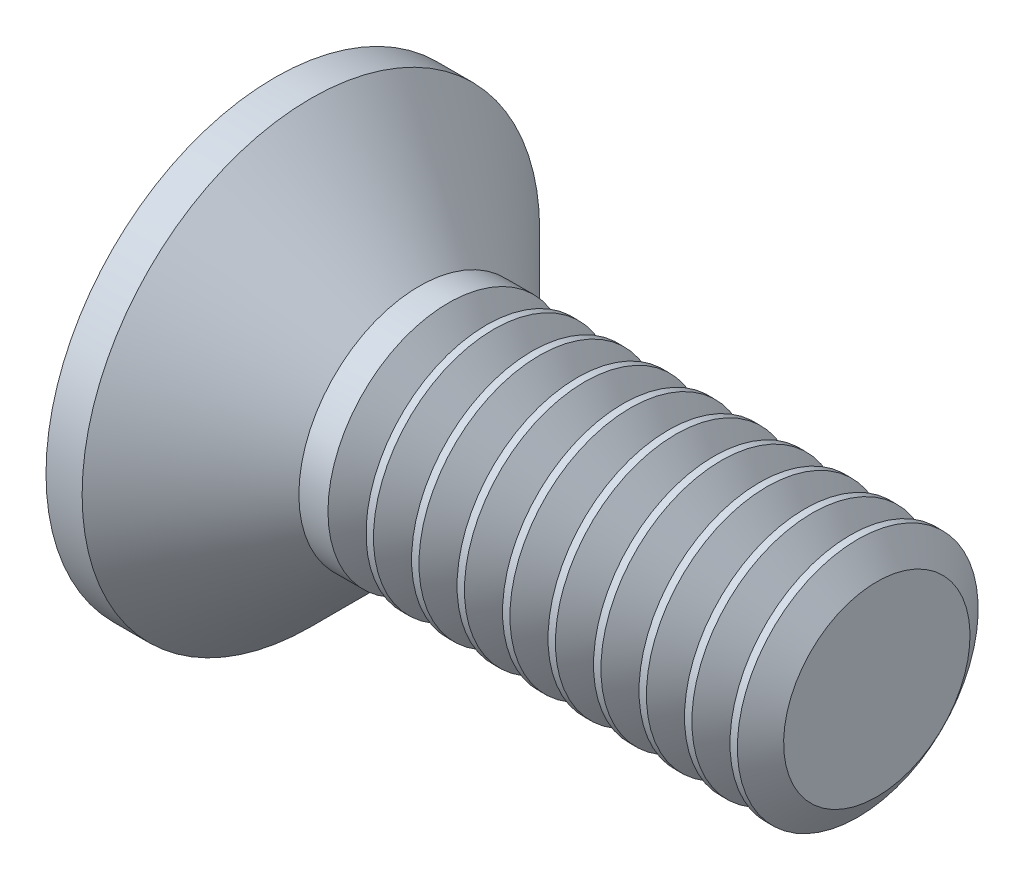
ISO-10303-21;
HEADER;
FILE_DESCRIPTION(('STEP AP214'),'2;1');
FILE_NAME('part.step','',(''),(''),'','','');
FILE_SCHEMA(('AUTOMOTIVE_DESIGN { 1 0 10303 214 1 1 1 1 }'));
ENDSEC;
DATA;
#1=APPLICATION_CONTEXT('core data for automotive mechanical design processes');
#2=APPLICATION_PROTOCOL_DEFINITION('international standard','automotive_design',2000,#1);
#3=PRODUCT_CONTEXT('',#1,'mechanical');
#4=PRODUCT('Part','Part','',(#3));
#5=PRODUCT_RELATED_PRODUCT_CATEGORY('part','',(#4));
#6=PRODUCT_DEFINITION_FORMATION('','',#4);
#7=PRODUCT_DEFINITION_CONTEXT('part definition',#1,'design');
#8=PRODUCT_DEFINITION('design','',#6,#7);
#9=PRODUCT_DEFINITION_SHAPE('','',#8);
#10=(LENGTH_UNIT() NAMED_UNIT(*) SI_UNIT(.MILLI.,.METRE.));
#11=(NAMED_UNIT(*) PLANE_ANGLE_UNIT() SI_UNIT($,.RADIAN.));
#12=(NAMED_UNIT(*) SI_UNIT($,.STERADIAN.) SOLID_ANGLE_UNIT());
#13=UNCERTAINTY_MEASURE_WITH_UNIT(LENGTH_MEASURE(1.E-05),#10,'distance_accuracy_value','');
#14=(GEOMETRIC_REPRESENTATION_CONTEXT(3) GLOBAL_UNCERTAINTY_ASSIGNED_CONTEXT((#13)) GLOBAL_UNIT_ASSIGNED_CONTEXT((#10,
#11,#12)) REPRESENTATION_CONTEXT('',''));
#15=CARTESIAN_POINT('',(0.,0.,0.));
#16=DIRECTION('',(0.,0.,1.));
#17=DIRECTION('',(1.,0.,0.));
#18=AXIS2_PLACEMENT_3D('',#15,#16,#17);
#19=CARTESIAN_POINT('',(0.,0.,0.));
#20=DIRECTION('',(-1.,0.,0.));
#21=DIRECTION('',(0.,0.,1.));
#22=AXIS2_PLACEMENT_3D('',#19,#20,#21);
#23=PLANE('',#22);
#24=CARTESIAN_POINT('',(0.,0.,0.));
#25=DIRECTION('',(-1.,0.,0.));
#26=DIRECTION('',(0.,0.,1.));
#27=AXIS2_PLACEMENT_3D('',#24,#25,#26);
#28=CIRCLE('',#27,1.9);
#29=CARTESIAN_POINT('',(0.,0.,1.9));
#30=VERTEX_POINT('',#29);
#31=EDGE_CURVE('E42',#30,#30,#28,.T.);
#32=ORIENTED_EDGE('',*,*,#31,.T.);
#33=EDGE_LOOP('',(#32));
#34=FACE_BOUND('',#33,.T.);
#35=DIRECTION('',(0.,1.,0.));
#36=VECTOR('',#35,1.);
#37=CARTESIAN_POINT('',(0.,-1.07,-0.264999999999999));
#38=LINE('',#37,#36);
#39=CARTESIAN_POINT('',(0.,-1.07,-0.264999999999999));
#40=VERTEX_POINT('',#39);
#41=CARTESIAN_POINT('',(0.,-0.264999999999999,-0.264999999999999));
#42=VERTEX_POINT('',#41);
#43=EDGE_CURVE('E103',#40,#42,#38,.T.);
#44=ORIENTED_EDGE('',*,*,#43,.T.);
#45=DIRECTION('',(0.,0.,-1.));
#46=VECTOR('',#45,1.);
#47=CARTESIAN_POINT('',(0.,-0.265000000000004,1.07));
#48=LINE('',#47,#46);
#49=CARTESIAN_POINT('',(0.,-0.264999999999996,-1.07));
#50=VERTEX_POINT('',#49);
#51=EDGE_CURVE('E83',#42,#50,#48,.T.);
#52=ORIENTED_EDGE('',*,*,#51,.T.);
#53=DIRECTION('',(0.,1.,0.));
#54=VECTOR('',#53,1.);
#55=CARTESIAN_POINT('',(0.,-0.264999999999996,-1.07));
#56=LINE('',#55,#54);
#57=CARTESIAN_POINT('',(0.,0.265000000000003,-1.07));
#58=VERTEX_POINT('',#57);
#59=EDGE_CURVE('E388',#50,#58,#56,.T.);
#60=ORIENTED_EDGE('',*,*,#59,.T.);
#61=DIRECTION('',(0.,0.,1.));
#62=VECTOR('',#61,1.);
#63=CARTESIAN_POINT('',(0.,0.265000000000003,-1.07));
#64=LINE('',#63,#62);
#65=CARTESIAN_POINT('',(0.,0.265,-0.264999999999999));
#66=VERTEX_POINT('',#65);
#67=EDGE_CURVE('E99',#58,#66,#64,.T.);
#68=ORIENTED_EDGE('',*,*,#67,.T.);
#69=CARTESIAN_POINT('',(0.,1.07,-0.264999999999999));
#70=VERTEX_POINT('',#69);
#71=EDGE_CURVE('E93',#66,#70,#38,.T.);
#72=ORIENTED_EDGE('',*,*,#71,.T.);
#73=DIRECTION('',(0.,0.,1.));
#74=VECTOR('',#73,1.);
#75=CARTESIAN_POINT('',(0.,1.07,-0.264999999999999));
#76=LINE('',#75,#74);
#77=CARTESIAN_POINT('',(0.,1.07,0.265));
#78=VERTEX_POINT('',#77);
#79=EDGE_CURVE('E96',#70,#78,#76,.T.);
#80=ORIENTED_EDGE('',*,*,#79,.T.);
#81=DIRECTION('',(0.,-1.,0.));
#82=VECTOR('',#81,1.);
#83=CARTESIAN_POINT('',(0.,1.07,0.265));
#84=LINE('',#83,#82);
#85=CARTESIAN_POINT('',(0.,0.264999999999998,0.265));
#86=VERTEX_POINT('',#85);
#87=EDGE_CURVE('E406',#78,#86,#84,.T.);
#88=ORIENTED_EDGE('',*,*,#87,.T.);
#89=CARTESIAN_POINT('',(0.,0.264999999999995,1.07));
#90=VERTEX_POINT('',#89);
#91=EDGE_CURVE('E391',#86,#90,#64,.T.);
#92=ORIENTED_EDGE('',*,*,#91,.T.);
#93=DIRECTION('',(0.,-1.,0.));
#94=VECTOR('',#93,1.);
#95=CARTESIAN_POINT('',(0.,0.264999999999995,1.07));
#96=LINE('',#95,#94);
#97=CARTESIAN_POINT('',(0.,-0.265000000000004,1.07));
#98=VERTEX_POINT('',#97);
#99=EDGE_CURVE('E382',#90,#98,#96,.T.);
#100=ORIENTED_EDGE('',*,*,#99,.T.);
#101=CARTESIAN_POINT('',(0.,-0.265000000000001,0.265));
#102=VERTEX_POINT('',#101);
#103=EDGE_CURVE('E385',#98,#102,#48,.T.);
#104=ORIENTED_EDGE('',*,*,#103,.T.);
#105=CARTESIAN_POINT('',(0.,-1.07,0.265));
#106=VERTEX_POINT('',#105);
#107=EDGE_CURVE('E109',#102,#106,#84,.T.);
#108=ORIENTED_EDGE('',*,*,#107,.T.);
#109=DIRECTION('',(0.,0.,-1.));
#110=VECTOR('',#109,1.);
#111=CARTESIAN_POINT('',(0.,-1.07,0.265));
#112=LINE('',#111,#110);
#113=EDGE_CURVE('E132',#106,#40,#112,.T.);
#114=ORIENTED_EDGE('',*,*,#113,.T.);
#115=EDGE_LOOP('',(#44,#52,#60,#68,#72,#80,#88,#92,#100,#104,#108,#114));
#116=FACE_BOUND('',#115,.T.);
#117=ADVANCED_FACE('F35',(#34,#116),#23,.T.);
#118=CARTESIAN_POINT('',(1.75765333333333,0.,0.113773333333333));
#119=DIRECTION('',(-0.0857222578731988,0.,-0.996319072639443));
#120=DIRECTION('',(-0.996319072639444,0.,0.0857222578731988));
#121=AXIS2_PLACEMENT_3D('',#118,#119,#120);
#122=PLANE('',#121);
#123=ORIENTED_EDGE('',*,*,#107,.F.);
#124=DIRECTION('',(0.992678495991953,0.0854090264408663,-0.0854090264408661));
#125=VECTOR('',#124,1.);
#126=CARTESIAN_POINT('',(1.76729945793969,-0.112943390794151,0.112943390794151));
#127=LINE('',#126,#125);
#128=CARTESIAN_POINT('',(1.54,-0.132500000000001,0.1325));
#129=VERTEX_POINT('',#128);
#130=EDGE_CURVE('E127',#102,#129,#127,.T.);
#131=ORIENTED_EDGE('',*,*,#130,.T.);
#132=DIRECTION('',(0.851874354386278,0.518592342361776,-0.0732943843871311));
#133=VECTOR('',#132,1.);
#134=CARTESIAN_POINT('',(0.,-1.07,0.265));
#135=LINE('',#134,#133);
#136=EDGE_CURVE('E104',#106,#129,#135,.T.);
#137=ORIENTED_EDGE('',*,*,#136,.F.);
#138=EDGE_LOOP('',(#123,#131,#137));
#139=FACE_BOUND('',#138,.T.);
#140=ADVANCED_FACE('F152',(#139),#122,.T.);
#141=DIRECTION('',(0.851874354386278,-0.518592342361776,-0.0732943843871309));
#142=VECTOR('',#141,1.);
#143=CARTESIAN_POINT('',(0.,1.07,0.265));
#144=LINE('',#143,#142);
#145=CARTESIAN_POINT('',(1.54,0.1325,0.1325));
#146=VERTEX_POINT('',#145);
#147=EDGE_CURVE('E49',#78,#146,#144,.T.);
#148=ORIENTED_EDGE('',*,*,#147,.T.);
#149=DIRECTION('',(-0.992678495991954,0.0854090264408653,0.085409026440866));
#150=VECTOR('',#149,1.);
#151=CARTESIAN_POINT('',(1.76729945793969,0.11294339079415,0.112943390794151));
#152=LINE('',#151,#150);
#153=EDGE_CURVE('E401',#146,#86,#152,.T.);
#154=ORIENTED_EDGE('',*,*,#153,.T.);
#155=ORIENTED_EDGE('',*,*,#87,.F.);
#156=EDGE_LOOP('',(#148,#154,#155));
#157=FACE_BOUND('',#156,.T.);
#158=ADVANCED_FACE('F156',(#157),#122,.T.);
#159=CARTESIAN_POINT('',(1.75765333333333,0.,-0.113773333333333));
#160=DIRECTION('',(-0.0857222578731983,0.,0.996319072639444));
#161=DIRECTION('',(0.996319072639444,0.,0.0857222578731983));
#162=AXIS2_PLACEMENT_3D('',#159,#160,#161);
#163=PLANE('',#162);
#164=DIRECTION('',(0.851874354386278,0.518592342361776,0.0732943843871306));
#165=VECTOR('',#164,1.);
#166=CARTESIAN_POINT('',(0.,-1.07,-0.264999999999999));
#167=LINE('',#166,#165);
#168=CARTESIAN_POINT('',(1.54,-0.1325,-0.132500000000001));
#169=VERTEX_POINT('',#168);
#170=EDGE_CURVE('E58',#40,#169,#167,.T.);
#171=ORIENTED_EDGE('',*,*,#170,.T.);
#172=DIRECTION('',(-0.992678495991954,-0.0854090264408658,-0.0854090264408656));
#173=VECTOR('',#172,1.);
#174=CARTESIAN_POINT('',(1.76729945793969,-0.11294339079415,-0.11294339079415));
#175=LINE('',#174,#173);
#176=EDGE_CURVE('E11',#169,#42,#175,.T.);
#177=ORIENTED_EDGE('',*,*,#176,.T.);
#178=ORIENTED_EDGE('',*,*,#43,.F.);
#179=EDGE_LOOP('',(#171,#177,#178));
#180=FACE_BOUND('',#179,.T.);
#181=ADVANCED_FACE('F149',(#180),#163,.T.);
#182=ORIENTED_EDGE('',*,*,#71,.F.);
#183=DIRECTION('',(0.992678495991953,-0.0854090264408659,0.0854090264408656));
#184=VECTOR('',#183,1.);
#185=CARTESIAN_POINT('',(1.76729945793969,0.112943390794151,-0.11294339079415));
#186=LINE('',#185,#184);
#187=CARTESIAN_POINT('',(1.54,0.1325,-0.1325));
#188=VERTEX_POINT('',#187);
#189=EDGE_CURVE('E112',#66,#188,#186,.T.);
#190=ORIENTED_EDGE('',*,*,#189,.T.);
#191=DIRECTION('',(0.851874354386278,-0.518592342361776,0.0732943843871306));
#192=VECTOR('',#191,1.);
#193=CARTESIAN_POINT('',(0.,1.07,-0.264999999999999));
#194=LINE('',#193,#192);
#195=EDGE_CURVE('E108',#70,#188,#194,.T.);
#196=ORIENTED_EDGE('',*,*,#195,.F.);
#197=EDGE_LOOP('',(#182,#190,#196));
#198=FACE_BOUND('',#197,.T.);
#199=ADVANCED_FACE('F111',(#198),#163,.T.);
#200=CARTESIAN_POINT('',(-6.34999999999999,0.,0.));
#201=DIRECTION('',(-1.,0.,0.));
#202=DIRECTION('',(0.,0.,1.));
#203=AXIS2_PLACEMENT_3D('',#200,#201,#202);
#204=CYLINDRICAL_SURFACE('',#203,1.9);
#205=CARTESIAN_POINT('',(0.300000000000004,0.,0.));
#206=DIRECTION('',(-1.,0.,0.));
#207=DIRECTION('',(0.,0.,1.));
#208=AXIS2_PLACEMENT_3D('',#205,#206,#207);
#209=CIRCLE('',#208,1.9);
#210=CARTESIAN_POINT('',(0.300000000000004,0.,1.9));
#211=VERTEX_POINT('',#210);
#212=EDGE_CURVE('E131',#211,#211,#209,.T.);
#213=ORIENTED_EDGE('',*,*,#212,.T.);
#214=EDGE_LOOP('',(#213));
#215=FACE_BOUND('',#214,.T.);
#216=ORIENTED_EDGE('',*,*,#31,.F.);
#217=EDGE_LOOP('',(#216));
#218=FACE_BOUND('',#217,.T.);
#219=ADVANCED_FACE('F138',(#215,#218),#204,.T.);
#220=CARTESIAN_POINT('',(0.300000000000004,0.,0.));
#221=DIRECTION('',(-1.,0.,0.));
#222=DIRECTION('',(0.,0.,1.));
#223=AXIS2_PLACEMENT_3D('',#220,#221,#222);
#224=CONICAL_SURFACE('',#223,1.9,0.785398163397451);
#225=CARTESIAN_POINT('',(1.2,0.,0.));
#226=DIRECTION('',(-1.,0.,0.));
#227=DIRECTION('',(0.,0.,1.));
#228=AXIS2_PLACEMENT_3D('',#225,#226,#227);
#229=CIRCLE('',#228,1.);
#230=CARTESIAN_POINT('',(1.2,0.,1.));
#231=VERTEX_POINT('',#230);
#232=EDGE_CURVE('E128',#231,#231,#229,.T.);
#233=ORIENTED_EDGE('',*,*,#232,.T.);
#234=EDGE_LOOP('',(#233));
#235=FACE_BOUND('',#234,.T.);
#236=ORIENTED_EDGE('',*,*,#212,.F.);
#237=EDGE_LOOP('',(#236));
#238=FACE_BOUND('',#237,.T.);
#239=ADVANCED_FACE('F140',(#235,#238),#224,.T.);
#240=CARTESIAN_POINT('',(-6.34999999999999,0.,0.));
#241=DIRECTION('',(-1.,0.,0.));
#242=DIRECTION('',(0.,0.,1.));
#243=AXIS2_PLACEMENT_3D('',#240,#241,#242);
#244=CYLINDRICAL_SURFACE('',#243,1.);
#245=CARTESIAN_POINT('',(1.4417540963646,0.,0.));
#246=DIRECTION('',(-1.,0.,0.));
#247=DIRECTION('',(0.,-1.,0.));
#248=AXIS2_PLACEMENT_3D('',#245,#246,#247);
#249=CIRCLE('',#248,1.);
#250=CARTESIAN_POINT('',(1.4417540963646,-1.,0.));
#251=VERTEX_POINT('',#250);
#252=EDGE_CURVE('E376',#251,#251,#249,.T.);
#253=ORIENTED_EDGE('',*,*,#252,.T.);
#254=EDGE_LOOP('',(#253));
#255=FACE_BOUND('',#254,.T.);
#256=ORIENTED_EDGE('',*,*,#232,.F.);
#257=EDGE_LOOP('',(#256));
#258=FACE_BOUND('',#257,.T.);
#259=ADVANCED_FACE('F146',(#255,#258),#244,.T.);
#260=CARTESIAN_POINT('',(1.54,0.1325,-0.1325));
#261=DIRECTION('',(1.,0.,0.));
#262=DIRECTION('',(0.,0.,-1.));
#263=AXIS2_PLACEMENT_3D('',#260,#261,#262);
#264=PLANE('',#263);
#265=DIRECTION('',(0.,1.,0.));
#266=VECTOR('',#265,1.);
#267=CARTESIAN_POINT('',(1.54,-0.1325,-0.1325));
#268=LINE('',#267,#266);
#269=EDGE_CURVE('E123',#169,#188,#268,.T.);
#270=ORIENTED_EDGE('',*,*,#269,.F.);
#271=DIRECTION('',(0.,0.,-1.));
#272=VECTOR('',#271,1.);
#273=CARTESIAN_POINT('',(1.54,-0.1325,0.1325));
#274=LINE('',#273,#272);
#275=EDGE_CURVE('E114',#129,#169,#274,.T.);
#276=ORIENTED_EDGE('',*,*,#275,.F.);
#277=DIRECTION('',(0.,-1.,0.));
#278=VECTOR('',#277,1.);
#279=CARTESIAN_POINT('',(1.54,0.1325,0.1325));
#280=LINE('',#279,#278);
#281=EDGE_CURVE('E117',#146,#129,#280,.T.);
#282=ORIENTED_EDGE('',*,*,#281,.F.);
#283=DIRECTION('',(0.,0.,1.));
#284=VECTOR('',#283,1.);
#285=CARTESIAN_POINT('',(1.54,0.1325,-0.1325));
#286=LINE('',#285,#284);
#287=EDGE_CURVE('E121',#188,#146,#286,.T.);
#288=ORIENTED_EDGE('',*,*,#287,.F.);
#289=EDGE_LOOP('',(#270,#276,#282,#288));
#290=FACE_BOUND('',#289,.T.);
#291=ADVANCED_FACE('F173',(#290),#264,.F.);
#292=CARTESIAN_POINT('',(0.,-1.07,-0.264999999999999));
#293=DIRECTION('',(-0.519990936244092,0.854171777936963,0.));
#294=DIRECTION('',(-0.854171777936963,-0.519990936244092,0.));
#295=AXIS2_PLACEMENT_3D('',#292,#293,#294);
#296=PLANE('',#295);
#297=ORIENTED_EDGE('',*,*,#170,.F.);
#298=ORIENTED_EDGE('',*,*,#113,.F.);
#299=ORIENTED_EDGE('',*,*,#136,.T.);
#300=ORIENTED_EDGE('',*,*,#275,.T.);
#301=EDGE_LOOP('',(#297,#298,#299,#300));
#302=FACE_BOUND('',#301,.T.);
#303=ADVANCED_FACE('F165',(#302),#296,.T.);
#304=CARTESIAN_POINT('',(1.54,0.1325,0.1325));
#305=DIRECTION('',(-0.519990936244092,-0.854171777936963,0.));
#306=DIRECTION('',(0.854171777936963,-0.519990936244092,0.));
#307=AXIS2_PLACEMENT_3D('',#304,#305,#306);
#308=PLANE('',#307);
#309=ORIENTED_EDGE('',*,*,#147,.F.);
#310=ORIENTED_EDGE('',*,*,#79,.F.);
#311=ORIENTED_EDGE('',*,*,#195,.T.);
#312=ORIENTED_EDGE('',*,*,#287,.T.);
#313=EDGE_LOOP('',(#309,#310,#311,#312));
#314=FACE_BOUND('',#313,.T.);
#315=ADVANCED_FACE('F107',(#314),#308,.T.);
#316=CARTESIAN_POINT('',(1.75765333333333,-0.113773333333333,0.));
#317=DIRECTION('',(-0.0857222578731988,0.996319072639443,0.));
#318=DIRECTION('',(-0.996319072639444,-0.0857222578731988,0.));
#319=AXIS2_PLACEMENT_3D('',#316,#317,#318);
#320=PLANE('',#319);
#321=DIRECTION('',(0.851874354386278,0.0732943843871292,0.518592342361776));
#322=VECTOR('',#321,1.);
#323=CARTESIAN_POINT('',(0.,-0.264999999999996,-1.07));
#324=LINE('',#323,#322);
#325=EDGE_CURVE('E392',#50,#169,#324,.T.);
#326=ORIENTED_EDGE('',*,*,#325,.F.);
#327=ORIENTED_EDGE('',*,*,#51,.F.);
#328=ORIENTED_EDGE('',*,*,#176,.F.);
#329=EDGE_LOOP('',(#326,#327,#328));
#330=FACE_BOUND('',#329,.T.);
#331=ADVANCED_FACE('F172',(#330),#320,.T.);
#332=CARTESIAN_POINT('',(1.75765333333333,0.113773333333333,0.));
#333=DIRECTION('',(-0.0857222578731983,-0.996319072639444,0.));
#334=DIRECTION('',(0.996319072639444,-0.0857222578731983,0.));
#335=AXIS2_PLACEMENT_3D('',#332,#333,#334);
#336=PLANE('',#335);
#337=ORIENTED_EDGE('',*,*,#67,.F.);
#338=DIRECTION('',(0.851874354386278,-0.0732943843871324,0.518592342361776));
#339=VECTOR('',#338,1.);
#340=CARTESIAN_POINT('',(0.,0.265000000000003,-1.07));
#341=LINE('',#340,#339);
#342=EDGE_CURVE('E74',#58,#188,#341,.T.);
#343=ORIENTED_EDGE('',*,*,#342,.T.);
#344=ORIENTED_EDGE('',*,*,#189,.F.);
#345=EDGE_LOOP('',(#337,#343,#344));
#346=FACE_BOUND('',#345,.T.);
#347=ADVANCED_FACE('F444',(#346),#336,.T.);
#348=CARTESIAN_POINT('',(0.,0.265000000000003,-1.07));
#349=DIRECTION('',(-0.519990936244092,0.,0.854171777936963));
#350=DIRECTION('',(-0.854171777936963,0.,-0.519990936244092));
#351=AXIS2_PLACEMENT_3D('',#348,#349,#350);
#352=PLANE('',#351);
#353=ORIENTED_EDGE('',*,*,#342,.F.);
#354=ORIENTED_EDGE('',*,*,#59,.F.);
#355=ORIENTED_EDGE('',*,*,#325,.T.);
#356=ORIENTED_EDGE('',*,*,#269,.T.);
#357=EDGE_LOOP('',(#353,#354,#355,#356));
#358=FACE_BOUND('',#357,.T.);
#359=ADVANCED_FACE('F443',(#358),#352,.T.);
#360=ORIENTED_EDGE('',*,*,#103,.F.);
#361=DIRECTION('',(0.851874354386278,0.0732943843871327,-0.518592342361776));
#362=VECTOR('',#361,1.);
#363=CARTESIAN_POINT('',(0.,-0.265000000000004,1.07));
#364=LINE('',#363,#362);
#365=EDGE_CURVE('E396',#98,#129,#364,.T.);
#366=ORIENTED_EDGE('',*,*,#365,.T.);
#367=ORIENTED_EDGE('',*,*,#130,.F.);
#368=EDGE_LOOP('',(#360,#366,#367));
#369=FACE_BOUND('',#368,.T.);
#370=ADVANCED_FACE('F436',(#369),#320,.T.);
#371=DIRECTION('',(0.851874354386278,-0.0732943843871288,-0.518592342361776));
#372=VECTOR('',#371,1.);
#373=CARTESIAN_POINT('',(0.,0.264999999999995,1.07));
#374=LINE('',#373,#372);
#375=EDGE_CURVE('E381',#90,#146,#374,.T.);
#376=ORIENTED_EDGE('',*,*,#375,.F.);
#377=ORIENTED_EDGE('',*,*,#91,.F.);
#378=ORIENTED_EDGE('',*,*,#153,.F.);
#379=EDGE_LOOP('',(#376,#377,#378));
#380=FACE_BOUND('',#379,.T.);
#381=ADVANCED_FACE('F424',(#380),#336,.T.);
#382=CARTESIAN_POINT('',(1.54,-0.132500000000001,0.1325));
#383=DIRECTION('',(-0.519990936244092,0.,-0.854171777936963));
#384=DIRECTION('',(0.854171777936963,0.,-0.519990936244092));
#385=AXIS2_PLACEMENT_3D('',#382,#383,#384);
#386=PLANE('',#385);
#387=ORIENTED_EDGE('',*,*,#365,.F.);
#388=ORIENTED_EDGE('',*,*,#99,.F.);
#389=ORIENTED_EDGE('',*,*,#375,.T.);
#390=ORIENTED_EDGE('',*,*,#281,.T.);
#391=EDGE_LOOP('',(#387,#388,#389,#390));
#392=FACE_BOUND('',#391,.T.);
#393=ADVANCED_FACE('F430',(#392),#386,.T.);
#394=CARTESIAN_POINT('',(1.75824790363539,0.,0.));
#395=DIRECTION('',(1.,0.,0.));
#396=DIRECTION('',(0.,1.,0.));
#397=AXIS2_PLACEMENT_3D('',#394,#395,#396);
#398=CONICAL_SURFACE('',#397,1.,0.95993108859688);
#399=CARTESIAN_POINT('',(1.600001,0.,0.));
#400=DIRECTION('',(-1.,0.,0.));
#401=DIRECTION('',(0.,-1.,0.));
#402=AXIS2_PLACEMENT_3D('',#399,#400,#401);
#403=CIRCLE('',#402,0.774000000000001);
#404=CARTESIAN_POINT('',(1.600001,-0.774,0.));
#405=VERTEX_POINT('',#404);
#406=EDGE_CURVE('E373',#405,#405,#403,.T.);
#407=ORIENTED_EDGE('',*,*,#406,.F.);
#408=EDGE_LOOP('',(#407));
#409=FACE_BOUND('',#408,.T.);
#410=CARTESIAN_POINT('',(1.75824790363539,0.,0.));
#411=DIRECTION('',(-1.,0.,0.));
#412=DIRECTION('',(0.,-1.,0.));
#413=AXIS2_PLACEMENT_3D('',#410,#411,#412);
#414=CIRCLE('',#413,1.);
#415=CARTESIAN_POINT('',(1.7582479036354,-1.,0.));
#416=VERTEX_POINT('',#415);
#417=EDGE_CURVE('E378',#416,#416,#414,.T.);
#418=ORIENTED_EDGE('',*,*,#417,.T.);
#419=EDGE_LOOP('',(#418));
#420=FACE_BOUND('',#419,.T.);
#421=ADVANCED_FACE('F206',(#409,#420),#398,.T.);
#422=CARTESIAN_POINT('',(1.600001,0.,0.));
#423=DIRECTION('',(-1.,0.,0.));
#424=DIRECTION('',(0.,-1.,0.));
#425=AXIS2_PLACEMENT_3D('',#422,#423,#424);
#426=CONICAL_SURFACE('',#425,0.774000000000001,0.959931088596875);
#427=ORIENTED_EDGE('',*,*,#252,.F.);
#428=EDGE_LOOP('',(#427));
#429=FACE_BOUND('',#428,.T.);
#430=ORIENTED_EDGE('',*,*,#406,.T.);
#431=EDGE_LOOP('',(#430));
#432=FACE_BOUND('',#431,.T.);
#433=ADVANCED_FACE('F196',(#429,#432),#426,.T.);
#434=CARTESIAN_POINT('',(1.81953187414238,0.,0.));
#435=DIRECTION('',(-1.,0.,0.));
#436=DIRECTION('',(0.,-1.,0.));
#437=AXIS2_PLACEMENT_3D('',#434,#435,#436);
#438=CIRCLE('',#437,1.);
#439=CARTESIAN_POINT('',(1.81953187414238,-1.,0.));
#440=VERTEX_POINT('',#439);
#441=EDGE_CURVE('E368',#440,#440,#438,.T.);
#442=ORIENTED_EDGE('',*,*,#441,.T.);
#443=EDGE_LOOP('',(#442));
#444=FACE_BOUND('',#443,.T.);
#445=ORIENTED_EDGE('',*,*,#417,.F.);
#446=EDGE_LOOP('',(#445));
#447=FACE_BOUND('',#446,.T.);
#448=ADVANCED_FACE('F185',(#444,#447),#244,.T.);
#449=CARTESIAN_POINT('',(2.13602568141317,0.,0.));
#450=DIRECTION('',(1.,0.,0.));
#451=DIRECTION('',(0.,1.,0.));
#452=AXIS2_PLACEMENT_3D('',#449,#450,#451);
#453=CONICAL_SURFACE('',#452,1.,0.95993108859688);
#454=CARTESIAN_POINT('',(1.97777877777778,0.,0.));
#455=DIRECTION('',(-1.,0.,0.));
#456=DIRECTION('',(0.,-1.,0.));
#457=AXIS2_PLACEMENT_3D('',#454,#455,#456);
#458=CIRCLE('',#457,0.774000000000001);
#459=CARTESIAN_POINT('',(1.97777877777778,-0.774,0.));
#460=VERTEX_POINT('',#459);
#461=EDGE_CURVE('E365',#460,#460,#458,.T.);
#462=ORIENTED_EDGE('',*,*,#461,.F.);
#463=EDGE_LOOP('',(#462));
#464=FACE_BOUND('',#463,.T.);
#465=CARTESIAN_POINT('',(2.13602568141317,0.,0.));
#466=DIRECTION('',(-1.,0.,0.));
#467=DIRECTION('',(0.,-1.,0.));
#468=AXIS2_PLACEMENT_3D('',#465,#466,#467);
#469=CIRCLE('',#468,1.);
#470=CARTESIAN_POINT('',(2.13602568141317,-1.,0.));
#471=VERTEX_POINT('',#470);
#472=EDGE_CURVE('E370',#471,#471,#469,.T.);
#473=ORIENTED_EDGE('',*,*,#472,.T.);
#474=EDGE_LOOP('',(#473));
#475=FACE_BOUND('',#474,.T.);
#476=ADVANCED_FACE('F195',(#464,#475),#453,.T.);
#477=CARTESIAN_POINT('',(1.97777877777778,0.,0.));
#478=DIRECTION('',(-1.,0.,0.));
#479=DIRECTION('',(0.,-1.,0.));
#480=AXIS2_PLACEMENT_3D('',#477,#478,#479);
#481=CONICAL_SURFACE('',#480,0.774000000000001,0.959931088596875);
#482=ORIENTED_EDGE('',*,*,#441,.F.);
#483=EDGE_LOOP('',(#482));
#484=FACE_BOUND('',#483,.T.);
#485=ORIENTED_EDGE('',*,*,#461,.T.);
#486=EDGE_LOOP('',(#485));
#487=FACE_BOUND('',#486,.T.);
#488=ADVANCED_FACE('F203',(#484,#487),#481,.T.);
#489=CARTESIAN_POINT('',(2.19730965192016,0.,0.));
#490=DIRECTION('',(-1.,0.,0.));
#491=DIRECTION('',(0.,-1.,0.));
#492=AXIS2_PLACEMENT_3D('',#489,#490,#491);
#493=CIRCLE('',#492,1.);
#494=CARTESIAN_POINT('',(2.19730965192016,-1.,0.));
#495=VERTEX_POINT('',#494);
#496=EDGE_CURVE('E360',#495,#495,#493,.T.);
#497=ORIENTED_EDGE('',*,*,#496,.T.);
#498=EDGE_LOOP('',(#497));
#499=FACE_BOUND('',#498,.T.);
#500=ORIENTED_EDGE('',*,*,#472,.F.);
#501=EDGE_LOOP('',(#500));
#502=FACE_BOUND('',#501,.T.);
#503=ADVANCED_FACE('F198',(#499,#502),#244,.T.);
#504=CARTESIAN_POINT('',(2.51380345919095,0.,0.));
#505=DIRECTION('',(1.,0.,0.));
#506=DIRECTION('',(0.,1.,0.));
#507=AXIS2_PLACEMENT_3D('',#504,#505,#506);
#508=CONICAL_SURFACE('',#507,1.,0.95993108859688);
#509=CARTESIAN_POINT('',(2.35555655555556,0.,0.));
#510=DIRECTION('',(-1.,0.,0.));
#511=DIRECTION('',(0.,-1.,0.));
#512=AXIS2_PLACEMENT_3D('',#509,#510,#511);
#513=CIRCLE('',#512,0.774000000000001);
#514=CARTESIAN_POINT('',(2.35555655555556,-0.774,0.));
#515=VERTEX_POINT('',#514);
#516=EDGE_CURVE('E357',#515,#515,#513,.T.);
#517=ORIENTED_EDGE('',*,*,#516,.F.);
#518=EDGE_LOOP('',(#517));
#519=FACE_BOUND('',#518,.T.);
#520=CARTESIAN_POINT('',(2.51380345919095,0.,0.));
#521=DIRECTION('',(-1.,0.,0.));
#522=DIRECTION('',(0.,-1.,0.));
#523=AXIS2_PLACEMENT_3D('',#520,#521,#522);
#524=CIRCLE('',#523,1.);
#525=CARTESIAN_POINT('',(2.51380345919095,-1.,0.));
#526=VERTEX_POINT('',#525);
#527=EDGE_CURVE('E362',#526,#526,#524,.T.);
#528=ORIENTED_EDGE('',*,*,#527,.T.);
#529=EDGE_LOOP('',(#528));
#530=FACE_BOUND('',#529,.T.);
#531=ADVANCED_FACE('F212',(#519,#530),#508,.T.);
#532=CARTESIAN_POINT('',(2.35555655555556,0.,0.));
#533=DIRECTION('',(-1.,0.,0.));
#534=DIRECTION('',(0.,-1.,0.));
#535=AXIS2_PLACEMENT_3D('',#532,#533,#534);
#536=CONICAL_SURFACE('',#535,0.774000000000001,0.959931088596875);
#537=ORIENTED_EDGE('',*,*,#496,.F.);
#538=EDGE_LOOP('',(#537));
#539=FACE_BOUND('',#538,.T.);
#540=ORIENTED_EDGE('',*,*,#516,.T.);
#541=EDGE_LOOP('',(#540));
#542=FACE_BOUND('',#541,.T.);
#543=ADVANCED_FACE('F219',(#539,#542),#536,.T.);
#544=CARTESIAN_POINT('',(2.57508742969794,0.,0.));
#545=DIRECTION('',(-1.,0.,0.));
#546=DIRECTION('',(0.,-1.,0.));
#547=AXIS2_PLACEMENT_3D('',#544,#545,#546);
#548=CIRCLE('',#547,1.);
#549=CARTESIAN_POINT('',(2.57508742969794,-1.,0.));
#550=VERTEX_POINT('',#549);
#551=EDGE_CURVE('E352',#550,#550,#548,.T.);
#552=ORIENTED_EDGE('',*,*,#551,.T.);
#553=EDGE_LOOP('',(#552));
#554=FACE_BOUND('',#553,.T.);
#555=ORIENTED_EDGE('',*,*,#527,.F.);
#556=EDGE_LOOP('',(#555));
#557=FACE_BOUND('',#556,.T.);
#558=ADVANCED_FACE('F214',(#554,#557),#244,.T.);
#559=CARTESIAN_POINT('',(2.89158123696873,0.,0.));
#560=DIRECTION('',(1.,0.,0.));
#561=DIRECTION('',(0.,1.,0.));
#562=AXIS2_PLACEMENT_3D('',#559,#560,#561);
#563=CONICAL_SURFACE('',#562,1.,0.95993108859688);
#564=CARTESIAN_POINT('',(2.73333433333333,0.,0.));
#565=DIRECTION('',(-1.,0.,0.));
#566=DIRECTION('',(0.,-1.,0.));
#567=AXIS2_PLACEMENT_3D('',#564,#565,#566);
#568=CIRCLE('',#567,0.774000000000001);
#569=CARTESIAN_POINT('',(2.73333433333333,-0.774,0.));
#570=VERTEX_POINT('',#569);
#571=EDGE_CURVE('E349',#570,#570,#568,.T.);
#572=ORIENTED_EDGE('',*,*,#571,.F.);
#573=EDGE_LOOP('',(#572));
#574=FACE_BOUND('',#573,.T.);
#575=CARTESIAN_POINT('',(2.89158123696873,0.,0.));
#576=DIRECTION('',(-1.,0.,0.));
#577=DIRECTION('',(0.,-1.,0.));
#578=AXIS2_PLACEMENT_3D('',#575,#576,#577);
#579=CIRCLE('',#578,1.);
#580=CARTESIAN_POINT('',(2.89158123696873,-1.,0.));
#581=VERTEX_POINT('',#580);
#582=EDGE_CURVE('E354',#581,#581,#579,.T.);
#583=ORIENTED_EDGE('',*,*,#582,.T.);
#584=EDGE_LOOP('',(#583));
#585=FACE_BOUND('',#584,.T.);
#586=ADVANCED_FACE('F227',(#574,#585),#563,.T.);
#587=CARTESIAN_POINT('',(2.73333433333333,0.,0.));
#588=DIRECTION('',(-1.,0.,0.));
#589=DIRECTION('',(0.,-1.,0.));
#590=AXIS2_PLACEMENT_3D('',#587,#588,#589);
#591=CONICAL_SURFACE('',#590,0.774000000000001,0.959931088596875);
#592=ORIENTED_EDGE('',*,*,#551,.F.);
#593=EDGE_LOOP('',(#592));
#594=FACE_BOUND('',#593,.T.);
#595=ORIENTED_EDGE('',*,*,#571,.T.);
#596=EDGE_LOOP('',(#595));
#597=FACE_BOUND('',#596,.T.);
#598=ADVANCED_FACE('F234',(#594,#597),#591,.T.);
#599=CARTESIAN_POINT('',(2.95286520747571,0.,0.));
#600=DIRECTION('',(-1.,0.,0.));
#601=DIRECTION('',(0.,-1.,0.));
#602=AXIS2_PLACEMENT_3D('',#599,#600,#601);
#603=CIRCLE('',#602,1.);
#604=CARTESIAN_POINT('',(2.95286520747571,-1.,0.));
#605=VERTEX_POINT('',#604);
#606=EDGE_CURVE('E344',#605,#605,#603,.T.);
#607=ORIENTED_EDGE('',*,*,#606,.T.);
#608=EDGE_LOOP('',(#607));
#609=FACE_BOUND('',#608,.T.);
#610=ORIENTED_EDGE('',*,*,#582,.F.);
#611=EDGE_LOOP('',(#610));
#612=FACE_BOUND('',#611,.T.);
#613=ADVANCED_FACE('F229',(#609,#612),#244,.T.);
#614=CARTESIAN_POINT('',(3.26935901474651,0.,0.));
#615=DIRECTION('',(1.,0.,0.));
#616=DIRECTION('',(0.,1.,0.));
#617=AXIS2_PLACEMENT_3D('',#614,#615,#616);
#618=CONICAL_SURFACE('',#617,1.,0.95993108859688);
#619=CARTESIAN_POINT('',(3.11111211111111,0.,0.));
#620=DIRECTION('',(-1.,0.,0.));
#621=DIRECTION('',(0.,-1.,0.));
#622=AXIS2_PLACEMENT_3D('',#619,#620,#621);
#623=CIRCLE('',#622,0.774000000000001);
#624=CARTESIAN_POINT('',(3.11111211111111,-0.774,0.));
#625=VERTEX_POINT('',#624);
#626=EDGE_CURVE('E341',#625,#625,#623,.T.);
#627=ORIENTED_EDGE('',*,*,#626,.F.);
#628=EDGE_LOOP('',(#627));
#629=FACE_BOUND('',#628,.T.);
#630=CARTESIAN_POINT('',(3.26935901474651,0.,0.));
#631=DIRECTION('',(-1.,0.,0.));
#632=DIRECTION('',(0.,-1.,0.));
#633=AXIS2_PLACEMENT_3D('',#630,#631,#632);
#634=CIRCLE('',#633,1.);
#635=CARTESIAN_POINT('',(3.26935901474651,-1.,0.));
#636=VERTEX_POINT('',#635);
#637=EDGE_CURVE('E346',#636,#636,#634,.T.);
#638=ORIENTED_EDGE('',*,*,#637,.T.);
#639=EDGE_LOOP('',(#638));
#640=FACE_BOUND('',#639,.T.);
#641=ADVANCED_FACE('F242',(#629,#640),#618,.T.);
#642=CARTESIAN_POINT('',(3.11111211111111,0.,0.));
#643=DIRECTION('',(-1.,0.,0.));
#644=DIRECTION('',(0.,-1.,0.));
#645=AXIS2_PLACEMENT_3D('',#642,#643,#644);
#646=CONICAL_SURFACE('',#645,0.774000000000001,0.959931088596875);
#647=ORIENTED_EDGE('',*,*,#606,.F.);
#648=EDGE_LOOP('',(#647));
#649=FACE_BOUND('',#648,.T.);
#650=ORIENTED_EDGE('',*,*,#626,.T.);
#651=EDGE_LOOP('',(#650));
#652=FACE_BOUND('',#651,.T.);
#653=ADVANCED_FACE('F249',(#649,#652),#646,.T.);
#654=CARTESIAN_POINT('',(3.33064298525349,0.,0.));
#655=DIRECTION('',(-1.,0.,0.));
#656=DIRECTION('',(0.,-1.,0.));
#657=AXIS2_PLACEMENT_3D('',#654,#655,#656);
#658=CIRCLE('',#657,1.);
#659=CARTESIAN_POINT('',(3.33064298525349,-1.,0.));
#660=VERTEX_POINT('',#659);
#661=EDGE_CURVE('E336',#660,#660,#658,.T.);
#662=ORIENTED_EDGE('',*,*,#661,.T.);
#663=EDGE_LOOP('',(#662));
#664=FACE_BOUND('',#663,.T.);
#665=ORIENTED_EDGE('',*,*,#637,.F.);
#666=EDGE_LOOP('',(#665));
#667=FACE_BOUND('',#666,.T.);
#668=ADVANCED_FACE('F244',(#664,#667),#244,.T.);
#669=CARTESIAN_POINT('',(3.64713679252428,0.,0.));
#670=DIRECTION('',(1.,0.,0.));
#671=DIRECTION('',(0.,1.,0.));
#672=AXIS2_PLACEMENT_3D('',#669,#670,#671);
#673=CONICAL_SURFACE('',#672,1.,0.95993108859688);
#674=CARTESIAN_POINT('',(3.48888988888889,0.,0.));
#675=DIRECTION('',(-1.,0.,0.));
#676=DIRECTION('',(0.,-1.,0.));
#677=AXIS2_PLACEMENT_3D('',#674,#675,#676);
#678=CIRCLE('',#677,0.774000000000001);
#679=CARTESIAN_POINT('',(3.48888988888889,-0.774,0.));
#680=VERTEX_POINT('',#679);
#681=EDGE_CURVE('E333',#680,#680,#678,.T.);
#682=ORIENTED_EDGE('',*,*,#681,.F.);
#683=EDGE_LOOP('',(#682));
#684=FACE_BOUND('',#683,.T.);
#685=CARTESIAN_POINT('',(3.64713679252428,0.,0.));
#686=DIRECTION('',(-1.,0.,0.));
#687=DIRECTION('',(0.,-1.,0.));
#688=AXIS2_PLACEMENT_3D('',#685,#686,#687);
#689=CIRCLE('',#688,1.);
#690=CARTESIAN_POINT('',(3.64713679252428,-1.,0.));
#691=VERTEX_POINT('',#690);
#692=EDGE_CURVE('E338',#691,#691,#689,.T.);
#693=ORIENTED_EDGE('',*,*,#692,.T.);
#694=EDGE_LOOP('',(#693));
#695=FACE_BOUND('',#694,.T.);
#696=ADVANCED_FACE('F257',(#684,#695),#673,.T.);
#697=CARTESIAN_POINT('',(3.48888988888889,0.,0.));
#698=DIRECTION('',(-1.,0.,0.));
#699=DIRECTION('',(0.,-1.,0.));
#700=AXIS2_PLACEMENT_3D('',#697,#698,#699);
#701=CONICAL_SURFACE('',#700,0.774000000000001,0.959931088596875);
#702=ORIENTED_EDGE('',*,*,#661,.F.);
#703=EDGE_LOOP('',(#702));
#704=FACE_BOUND('',#703,.T.);
#705=ORIENTED_EDGE('',*,*,#681,.T.);
#706=EDGE_LOOP('',(#705));
#707=FACE_BOUND('',#706,.T.);
#708=ADVANCED_FACE('F264',(#704,#707),#701,.T.);
#709=CARTESIAN_POINT('',(3.70842076303127,0.,0.));
#710=DIRECTION('',(-1.,0.,0.));
#711=DIRECTION('',(0.,-1.,0.));
#712=AXIS2_PLACEMENT_3D('',#709,#710,#711);
#713=CIRCLE('',#712,1.);
#714=CARTESIAN_POINT('',(3.70842076303127,-1.,0.));
#715=VERTEX_POINT('',#714);
#716=EDGE_CURVE('E323',#715,#715,#713,.T.);
#717=ORIENTED_EDGE('',*,*,#716,.T.);
#718=EDGE_LOOP('',(#717));
#719=FACE_BOUND('',#718,.T.);
#720=ORIENTED_EDGE('',*,*,#692,.F.);
#721=EDGE_LOOP('',(#720));
#722=FACE_BOUND('',#721,.T.);
#723=ADVANCED_FACE('F259',(#719,#722),#244,.T.);
#724=CARTESIAN_POINT('',(4.02491457030206,0.,0.));
#725=DIRECTION('',(1.,0.,0.));
#726=DIRECTION('',(0.,1.,0.));
#727=AXIS2_PLACEMENT_3D('',#724,#725,#726);
#728=CONICAL_SURFACE('',#727,1.,0.95993108859688);
#729=CARTESIAN_POINT('',(3.86666766666667,0.,0.));
#730=DIRECTION('',(-1.,0.,0.));
#731=DIRECTION('',(0.,-1.,0.));
#732=AXIS2_PLACEMENT_3D('',#729,#730,#731);
#733=CIRCLE('',#732,0.774000000000001);
#734=CARTESIAN_POINT('',(3.86666766666667,-0.774,0.));
#735=VERTEX_POINT('',#734);
#736=EDGE_CURVE('E319',#735,#735,#733,.T.);
#737=ORIENTED_EDGE('',*,*,#736,.F.);
#738=EDGE_LOOP('',(#737));
#739=FACE_BOUND('',#738,.T.);
#740=CARTESIAN_POINT('',(4.02491457030206,0.,0.));
#741=DIRECTION('',(-1.,0.,0.));
#742=DIRECTION('',(0.,-1.,0.));
#743=AXIS2_PLACEMENT_3D('',#740,#741,#742);
#744=CIRCLE('',#743,1.);
#745=CARTESIAN_POINT('',(4.02491457030206,-1.,0.));
#746=VERTEX_POINT('',#745);
#747=EDGE_CURVE('E330',#746,#746,#744,.T.);
#748=ORIENTED_EDGE('',*,*,#747,.T.);
#749=EDGE_LOOP('',(#748));
#750=FACE_BOUND('',#749,.T.);
#751=ADVANCED_FACE('F272',(#739,#750),#728,.T.);
#752=CARTESIAN_POINT('',(3.86666766666667,0.,0.));
#753=DIRECTION('',(-1.,0.,0.));
#754=DIRECTION('',(0.,-1.,0.));
#755=AXIS2_PLACEMENT_3D('',#752,#753,#754);
#756=CONICAL_SURFACE('',#755,0.774000000000001,0.959931088596875);
#757=ORIENTED_EDGE('',*,*,#716,.F.);
#758=EDGE_LOOP('',(#757));
#759=FACE_BOUND('',#758,.T.);
#760=ORIENTED_EDGE('',*,*,#736,.T.);
#761=EDGE_LOOP('',(#760));
#762=FACE_BOUND('',#761,.T.);
#763=ADVANCED_FACE('F279',(#759,#762),#756,.T.);
#764=CARTESIAN_POINT('',(4.08619854080905,0.,0.));
#765=DIRECTION('',(-1.,0.,0.));
#766=DIRECTION('',(0.,-1.,0.));
#767=AXIS2_PLACEMENT_3D('',#764,#765,#766);
#768=CIRCLE('',#767,1.);
#769=CARTESIAN_POINT('',(4.08619854080905,-1.,0.));
#770=VERTEX_POINT('',#769);
#771=EDGE_CURVE('E320',#770,#770,#768,.T.);
#772=ORIENTED_EDGE('',*,*,#771,.T.);
#773=EDGE_LOOP('',(#772));
#774=FACE_BOUND('',#773,.T.);
#775=ORIENTED_EDGE('',*,*,#747,.F.);
#776=EDGE_LOOP('',(#775));
#777=FACE_BOUND('',#776,.T.);
#778=ADVANCED_FACE('F274',(#774,#777),#244,.T.);
#779=CARTESIAN_POINT('',(4.40269234807984,0.,0.));
#780=DIRECTION('',(1.,0.,0.));
#781=DIRECTION('',(0.,1.,0.));
#782=AXIS2_PLACEMENT_3D('',#779,#780,#781);
#783=CONICAL_SURFACE('',#782,1.,0.95993108859688);
#784=CARTESIAN_POINT('',(4.24444544444444,0.,0.));
#785=DIRECTION('',(-1.,0.,0.));
#786=DIRECTION('',(0.,-1.,0.));
#787=AXIS2_PLACEMENT_3D('',#784,#785,#786);
#788=CIRCLE('',#787,0.774000000000001);
#789=CARTESIAN_POINT('',(4.24444544444444,-0.774,0.));
#790=VERTEX_POINT('',#789);
#791=EDGE_CURVE('E325',#790,#790,#788,.T.);
#792=ORIENTED_EDGE('',*,*,#791,.F.);
#793=EDGE_LOOP('',(#792));
#794=FACE_BOUND('',#793,.T.);
#795=CARTESIAN_POINT('',(4.40269234807984,0.,0.));
#796=DIRECTION('',(-1.,0.,0.));
#797=DIRECTION('',(0.,-1.,0.));
#798=AXIS2_PLACEMENT_3D('',#795,#796,#797);
#799=CIRCLE('',#798,1.);
#800=CARTESIAN_POINT('',(4.40269234807984,-1.,0.));
#801=VERTEX_POINT('',#800);
#802=EDGE_CURVE('E317',#801,#801,#799,.T.);
#803=ORIENTED_EDGE('',*,*,#802,.T.);
#804=EDGE_LOOP('',(#803));
#805=FACE_BOUND('',#804,.T.);
#806=ADVANCED_FACE('F287',(#794,#805),#783,.T.);
#807=CARTESIAN_POINT('',(4.24444544444444,0.,0.));
#808=DIRECTION('',(-1.,0.,0.));
#809=DIRECTION('',(0.,-1.,0.));
#810=AXIS2_PLACEMENT_3D('',#807,#808,#809);
#811=CONICAL_SURFACE('',#810,0.774000000000001,0.959931088596875);
#812=ORIENTED_EDGE('',*,*,#771,.F.);
#813=EDGE_LOOP('',(#812));
#814=FACE_BOUND('',#813,.T.);
#815=ORIENTED_EDGE('',*,*,#791,.T.);
#816=EDGE_LOOP('',(#815));
#817=FACE_BOUND('',#816,.T.);
#818=ADVANCED_FACE('F293',(#814,#817),#811,.T.);
#819=CARTESIAN_POINT('',(4.46397631858683,0.,0.));
#820=DIRECTION('',(-1.,0.,0.));
#821=DIRECTION('',(0.,-1.,0.));
#822=AXIS2_PLACEMENT_3D('',#819,#820,#821);
#823=CIRCLE('',#822,1.);
#824=CARTESIAN_POINT('',(4.46397631858683,-1.,0.));
#825=VERTEX_POINT('',#824);
#826=EDGE_CURVE('E314',#825,#825,#823,.T.);
#827=ORIENTED_EDGE('',*,*,#826,.T.);
#828=EDGE_LOOP('',(#827));
#829=FACE_BOUND('',#828,.T.);
#830=ORIENTED_EDGE('',*,*,#802,.F.);
#831=EDGE_LOOP('',(#830));
#832=FACE_BOUND('',#831,.T.);
#833=ADVANCED_FACE('F193',(#829,#832),#244,.T.);
#834=CARTESIAN_POINT('',(4.78047012585762,0.,0.));
#835=DIRECTION('',(1.,0.,0.));
#836=DIRECTION('',(0.,1.,0.));
#837=AXIS2_PLACEMENT_3D('',#834,#835,#836);
#838=CONICAL_SURFACE('',#837,1.,0.95993108859688);
#839=CARTESIAN_POINT('',(4.62222322222222,0.,0.));
#840=DIRECTION('',(-1.,0.,0.));
#841=DIRECTION('',(0.,-1.,0.));
#842=AXIS2_PLACEMENT_3D('',#839,#840,#841);
#843=CIRCLE('',#842,0.774000000000001);
#844=CARTESIAN_POINT('',(4.62222322222222,-0.774,0.));
#845=VERTEX_POINT('',#844);
#846=EDGE_CURVE('E730',#845,#845,#843,.T.);
#847=ORIENTED_EDGE('',*,*,#846,.F.);
#848=EDGE_LOOP('',(#847));
#849=FACE_BOUND('',#848,.T.);
#850=CARTESIAN_POINT('',(4.78047012585762,0.,0.));
#851=DIRECTION('',(-1.,0.,0.));
#852=DIRECTION('',(0.,-1.,0.));
#853=AXIS2_PLACEMENT_3D('',#850,#851,#852);
#854=CIRCLE('',#853,1.);
#855=CARTESIAN_POINT('',(4.78047012585762,-1.,0.));
#856=VERTEX_POINT('',#855);
#857=EDGE_CURVE('E736',#856,#856,#854,.T.);
#858=ORIENTED_EDGE('',*,*,#857,.T.);
#859=EDGE_LOOP('',(#858));
#860=FACE_BOUND('',#859,.T.);
#861=ADVANCED_FACE('F301',(#849,#860),#838,.T.);
#862=CARTESIAN_POINT('',(4.62222322222222,0.,0.));
#863=DIRECTION('',(-1.,0.,0.));
#864=DIRECTION('',(0.,-1.,0.));
#865=AXIS2_PLACEMENT_3D('',#862,#863,#864);
#866=CONICAL_SURFACE('',#865,0.774000000000001,0.959931088596875);
#867=ORIENTED_EDGE('',*,*,#826,.F.);
#868=EDGE_LOOP('',(#867));
#869=FACE_BOUND('',#868,.T.);
#870=ORIENTED_EDGE('',*,*,#846,.T.);
#871=EDGE_LOOP('',(#870));
#872=FACE_BOUND('',#871,.T.);
#873=ADVANCED_FACE('F191',(#869,#872),#866,.T.);
#874=CARTESIAN_POINT('',(4.8417540963646,0.,0.));
#875=DIRECTION('',(-1.,0.,0.));
#876=DIRECTION('',(0.,-1.,0.));
#877=AXIS2_PLACEMENT_3D('',#874,#875,#876);
#878=CIRCLE('',#877,1.);
#879=CARTESIAN_POINT('',(4.8417540963646,-1.,0.));
#880=VERTEX_POINT('',#879);
#881=EDGE_CURVE('E725',#880,#880,#878,.T.);
#882=ORIENTED_EDGE('',*,*,#881,.T.);
#883=EDGE_LOOP('',(#882));
#884=FACE_BOUND('',#883,.T.);
#885=ORIENTED_EDGE('',*,*,#857,.F.);
#886=EDGE_LOOP('',(#885));
#887=FACE_BOUND('',#886,.T.);
#888=ADVANCED_FACE('F184',(#884,#887),#244,.T.);
#889=CARTESIAN_POINT('',(5.000001,0.,0.));
#890=DIRECTION('',(-1.,0.,0.));
#891=DIRECTION('',(0.,-1.,0.));
#892=AXIS2_PLACEMENT_3D('',#889,#890,#891);
#893=CONICAL_SURFACE('',#892,0.774000000000001,0.959931088596875);
#894=ORIENTED_EDGE('',*,*,#881,.F.);
#895=EDGE_LOOP('',(#894));
#896=FACE_BOUND('',#895,.T.);
#897=CARTESIAN_POINT('',(5.000001,0.,0.));
#898=DIRECTION('',(-1.,0.,0.));
#899=DIRECTION('',(0.,-1.,0.));
#900=AXIS2_PLACEMENT_3D('',#897,#898,#899);
#901=CIRCLE('',#900,0.774000000000001);
#902=CARTESIAN_POINT('',(5.000001,-0.774,0.));
#903=VERTEX_POINT('',#902);
#904=EDGE_CURVE('E728',#903,#903,#901,.T.);
#905=ORIENTED_EDGE('',*,*,#904,.T.);
#906=EDGE_LOOP('',(#905));
#907=FACE_BOUND('',#906,.T.);
#908=ADVANCED_FACE('F180',(#896,#907),#893,.T.);
#909=CARTESIAN_POINT('',(5.,1.,0.));
#910=DIRECTION('',(1.,0.,0.));
#911=DIRECTION('',(0.,0.,-1.));
#912=AXIS2_PLACEMENT_3D('',#909,#910,#911);
#913=PLANE('',#912);
#914=ORIENTED_EDGE('',*,*,#904,.F.);
#915=EDGE_LOOP('',(#914));
#916=FACE_BOUND('',#915,.T.);
#917=ADVANCED_FACE('F177',(#916),#913,.T.);
#918=CLOSED_SHELL('',(#117,#140,#158,#181,#199,#219,#239,#259,#291,#303,#315,#331,#347,#359,
#370,#381,#393,#421,#433,#448,#476,#488,#503,#531,#543,#558,#586,#598,#613,#641,#653,#668,#696,
#708,#723,#751,#763,#778,#806,#818,#833,#861,#873,#888,#908,#917));
#919=MANIFOLD_SOLID_BREP('B2',#918);
#920=ADVANCED_BREP_SHAPE_REPRESENTATION('',(#18,#919),#14);
#921=SHAPE_DEFINITION_REPRESENTATION(#9,#920);
ENDSEC;
END-ISO-10303-21;
